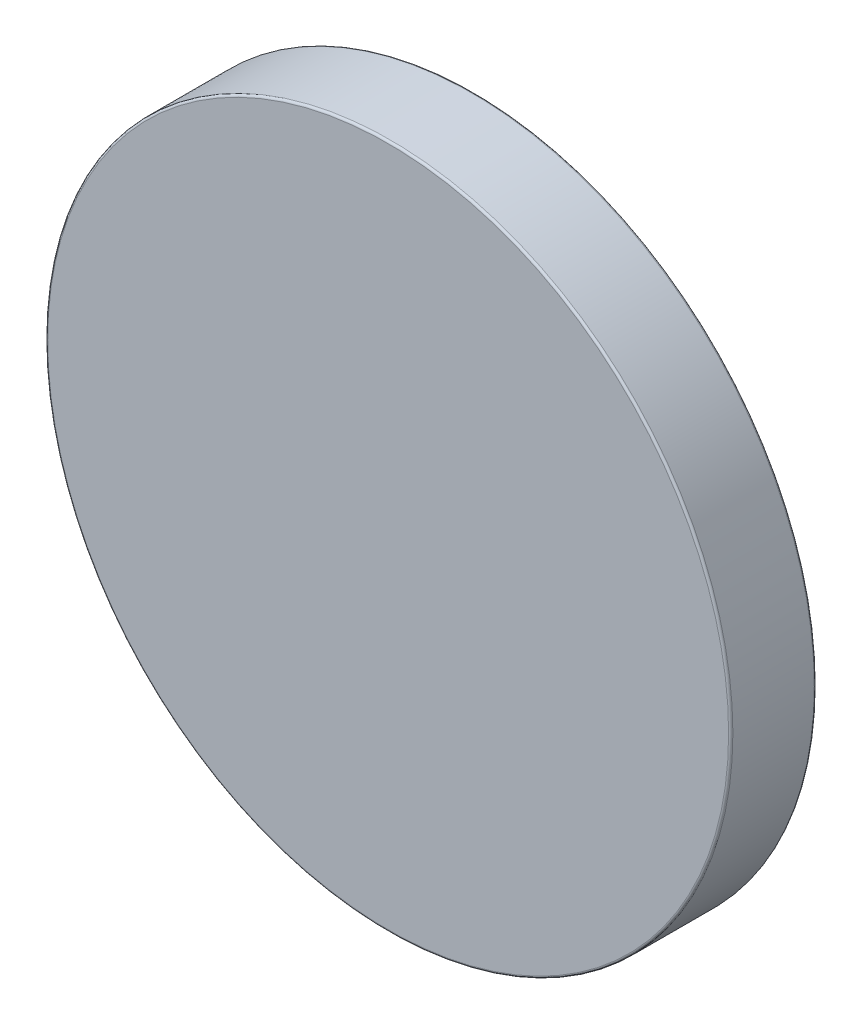
ISO-10303-21;
HEADER;
FILE_DESCRIPTION(('STEP AP214'),'2;1');
FILE_NAME('part.step','',(''),(''),'','','');
FILE_SCHEMA(('AUTOMOTIVE_DESIGN { 1 0 10303 214 1 1 1 1 }'));
ENDSEC;
DATA;
#1=APPLICATION_CONTEXT('core data for automotive mechanical design processes');
#2=APPLICATION_PROTOCOL_DEFINITION('international standard','automotive_design',2000,#1);
#3=PRODUCT_CONTEXT('',#1,'mechanical');
#4=PRODUCT('Part','Part','',(#3));
#5=PRODUCT_RELATED_PRODUCT_CATEGORY('part','',(#4));
#6=PRODUCT_DEFINITION_FORMATION('','',#4);
#7=PRODUCT_DEFINITION_CONTEXT('part definition',#1,'design');
#8=PRODUCT_DEFINITION('design','',#6,#7);
#9=PRODUCT_DEFINITION_SHAPE('','',#8);
#10=(LENGTH_UNIT() NAMED_UNIT(*) SI_UNIT(.MILLI.,.METRE.));
#11=(NAMED_UNIT(*) PLANE_ANGLE_UNIT() SI_UNIT($,.RADIAN.));
#12=(NAMED_UNIT(*) SI_UNIT($,.STERADIAN.) SOLID_ANGLE_UNIT());
#13=UNCERTAINTY_MEASURE_WITH_UNIT(LENGTH_MEASURE(1.E-05),#10,'distance_accuracy_value','');
#14=(GEOMETRIC_REPRESENTATION_CONTEXT(3) GLOBAL_UNCERTAINTY_ASSIGNED_CONTEXT((#13)) GLOBAL_UNIT_ASSIGNED_CONTEXT((#10,
#11,#12)) REPRESENTATION_CONTEXT('',''));
#15=CARTESIAN_POINT('',(0.,0.,0.));
#16=DIRECTION('',(0.,0.,1.));
#17=DIRECTION('',(1.,0.,0.));
#18=AXIS2_PLACEMENT_3D('',#15,#16,#17);
#19=CARTESIAN_POINT('',(0.,0.,1.5875));
#20=DIRECTION('',(0.,0.,-1.));
#21=DIRECTION('',(-1.,0.,0.));
#22=AXIS2_PLACEMENT_3D('',#19,#20,#21);
#23=CYLINDRICAL_SURFACE('',#22,12.7);
#24=CARTESIAN_POINT('',(0.,0.,-1.508125));
#25=DIRECTION('',(0.,0.,1.));
#26=DIRECTION('',(1.,0.,0.));
#27=AXIS2_PLACEMENT_3D('',#24,#25,#26);
#28=CIRCLE('',#27,12.7);
#29=CARTESIAN_POINT('',(12.7,0.,-1.508125));
#30=VERTEX_POINT('',#29);
#31=EDGE_CURVE('E41',#30,#30,#28,.T.);
#32=ORIENTED_EDGE('',*,*,#31,.T.);
#33=EDGE_LOOP('',(#32));
#34=FACE_BOUND('',#33,.T.);
#35=CARTESIAN_POINT('',(0.,0.,1.508125));
#36=DIRECTION('',(0.,0.,1.));
#37=DIRECTION('',(1.,0.,0.));
#38=AXIS2_PLACEMENT_3D('',#35,#36,#37);
#39=CIRCLE('',#38,12.7);
#40=CARTESIAN_POINT('',(12.7,0.,1.508125));
#41=VERTEX_POINT('',#40);
#42=EDGE_CURVE('E45',#41,#41,#39,.F.);
#43=ORIENTED_EDGE('',*,*,#42,.T.);
#44=EDGE_LOOP('',(#43));
#45=FACE_BOUND('',#44,.T.);
#46=ADVANCED_FACE('F30',(#34,#45),#23,.T.);
#47=CARTESIAN_POINT('',(0.,0.,1.5875));
#48=DIRECTION('',(0.,0.,1.));
#49=DIRECTION('',(1.,0.,0.));
#50=AXIS2_PLACEMENT_3D('',#47,#48,#49);
#51=PLANE('',#50);
#52=CARTESIAN_POINT('',(0.,0.,1.5875));
#53=DIRECTION('',(0.,0.,1.));
#54=DIRECTION('',(1.,0.,0.));
#55=AXIS2_PLACEMENT_3D('',#52,#53,#54);
#56=CIRCLE('',#55,12.620625);
#57=CARTESIAN_POINT('',(12.620625,0.,1.5875));
#58=VERTEX_POINT('',#57);
#59=EDGE_CURVE('E10',#58,#58,#56,.T.);
#60=ORIENTED_EDGE('',*,*,#59,.T.);
#61=EDGE_LOOP('',(#60));
#62=FACE_BOUND('',#61,.T.);
#63=ADVANCED_FACE('F61',(#62),#51,.T.);
#64=CARTESIAN_POINT('',(0.,0.,-1.5875));
#65=DIRECTION('',(0.,0.,1.));
#66=DIRECTION('',(1.,0.,0.));
#67=AXIS2_PLACEMENT_3D('',#64,#65,#66);
#68=PLANE('',#67);
#69=CARTESIAN_POINT('',(0.,0.,-1.5875));
#70=DIRECTION('',(0.,0.,1.));
#71=DIRECTION('',(1.,0.,0.));
#72=AXIS2_PLACEMENT_3D('',#69,#70,#71);
#73=CIRCLE('',#72,12.620625);
#74=CARTESIAN_POINT('',(12.620625,0.,-1.5875));
#75=VERTEX_POINT('',#74);
#76=EDGE_CURVE('E37',#75,#75,#73,.F.);
#77=ORIENTED_EDGE('',*,*,#76,.T.);
#78=EDGE_LOOP('',(#77));
#79=FACE_BOUND('',#78,.T.);
#80=ADVANCED_FACE('F58',(#79),#68,.F.);
#81=CARTESIAN_POINT('',(0.,0.,-1.508125));
#82=DIRECTION('',(0.,0.,1.));
#83=DIRECTION('',(1.,0.,0.));
#84=AXIS2_PLACEMENT_3D('',#81,#82,#83);
#85=TOROIDAL_SURFACE('',#84,12.620625,0.079375);
#86=ORIENTED_EDGE('',*,*,#76,.F.);
#87=EDGE_LOOP('',(#86));
#88=FACE_BOUND('',#87,.T.);
#89=ORIENTED_EDGE('',*,*,#31,.F.);
#90=EDGE_LOOP('',(#89));
#91=FACE_BOUND('',#90,.T.);
#92=ADVANCED_FACE('F54',(#88,#91),#85,.T.);
#93=CARTESIAN_POINT('',(0.,0.,1.508125));
#94=DIRECTION('',(0.,0.,1.));
#95=DIRECTION('',(1.,0.,0.));
#96=AXIS2_PLACEMENT_3D('',#93,#94,#95);
#97=TOROIDAL_SURFACE('',#96,12.620625,0.079375);
#98=ORIENTED_EDGE('',*,*,#42,.F.);
#99=EDGE_LOOP('',(#98));
#100=FACE_BOUND('',#99,.T.);
#101=ORIENTED_EDGE('',*,*,#59,.F.);
#102=EDGE_LOOP('',(#101));
#103=FACE_BOUND('',#102,.T.);
#104=ADVANCED_FACE('F32',(#100,#103),#97,.T.);
#105=CLOSED_SHELL('',(#46,#63,#80,#92,#104));
#106=MANIFOLD_SOLID_BREP('B2',#105);
#107=ADVANCED_BREP_SHAPE_REPRESENTATION('',(#18,#106),#14);
#108=SHAPE_DEFINITION_REPRESENTATION(#9,#107);
ENDSEC;
END-ISO-10303-21;
